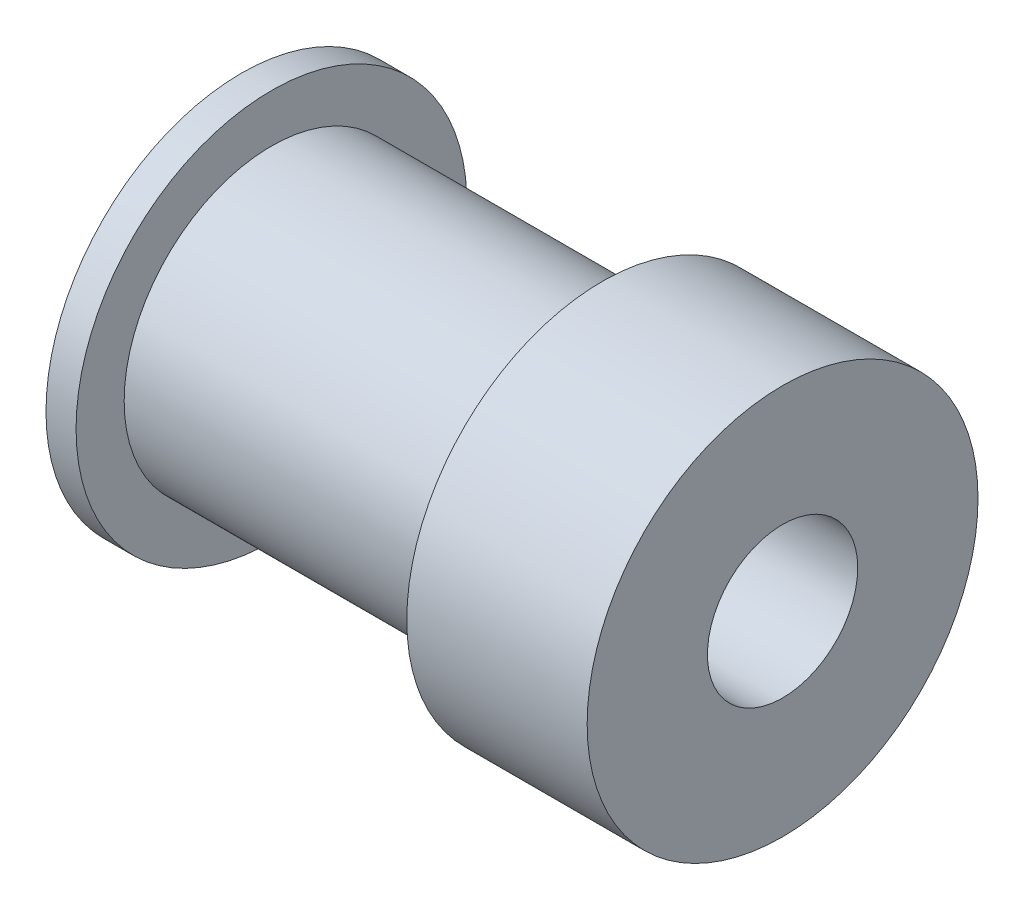
ISO-10303-21;
HEADER;
FILE_DESCRIPTION(('STEP AP214'),'2;1');
FILE_NAME('part.step','',(''),(''),'','','');
FILE_SCHEMA(('AUTOMOTIVE_DESIGN { 1 0 10303 214 1 1 1 1 }'));
ENDSEC;
DATA;
#1=APPLICATION_CONTEXT('core data for automotive mechanical design processes');
#2=APPLICATION_PROTOCOL_DEFINITION('international standard','automotive_design',2000,#1);
#3=PRODUCT_CONTEXT('',#1,'mechanical');
#4=PRODUCT('Part','Part','',(#3));
#5=PRODUCT_RELATED_PRODUCT_CATEGORY('part','',(#4));
#6=PRODUCT_DEFINITION_FORMATION('','',#4);
#7=PRODUCT_DEFINITION_CONTEXT('part definition',#1,'design');
#8=PRODUCT_DEFINITION('design','',#6,#7);
#9=PRODUCT_DEFINITION_SHAPE('','',#8);
#10=(LENGTH_UNIT() NAMED_UNIT(*) SI_UNIT(.MILLI.,.METRE.));
#11=(NAMED_UNIT(*) PLANE_ANGLE_UNIT() SI_UNIT($,.RADIAN.));
#12=(NAMED_UNIT(*) SI_UNIT($,.STERADIAN.) SOLID_ANGLE_UNIT());
#13=UNCERTAINTY_MEASURE_WITH_UNIT(LENGTH_MEASURE(1.E-05),#10,'distance_accuracy_value','');
#14=(GEOMETRIC_REPRESENTATION_CONTEXT(3) GLOBAL_UNCERTAINTY_ASSIGNED_CONTEXT((#13)) GLOBAL_UNIT_ASSIGNED_CONTEXT((#10,
#11,#12)) REPRESENTATION_CONTEXT('',''));
#15=CARTESIAN_POINT('',(0.,0.,0.));
#16=DIRECTION('',(0.,0.,1.));
#17=DIRECTION('',(1.,0.,0.));
#18=AXIS2_PLACEMENT_3D('',#15,#16,#17);
#19=CARTESIAN_POINT('',(18.,0.,0.));
#20=DIRECTION('',(-1.,0.,0.));
#21=DIRECTION('',(0.,0.,1.));
#22=AXIS2_PLACEMENT_3D('',#19,#20,#21);
#23=CYLINDRICAL_SURFACE('',#22,6.5);
#24=CARTESIAN_POINT('',(18.,0.,0.));
#25=DIRECTION('',(1.,0.,0.));
#26=DIRECTION('',(0.,0.,-1.));
#27=AXIS2_PLACEMENT_3D('',#24,#25,#26);
#28=CIRCLE('',#27,6.5);
#29=CARTESIAN_POINT('',(18.,0.,-6.5));
#30=VERTEX_POINT('',#29);
#31=EDGE_CURVE('E10',#30,#30,#28,.T.);
#32=ORIENTED_EDGE('',*,*,#31,.F.);
#33=EDGE_LOOP('',(#32));
#34=FACE_BOUND('',#33,.T.);
#35=CARTESIAN_POINT('',(12.,0.,0.));
#36=DIRECTION('',(-1.,0.,0.));
#37=DIRECTION('',(0.,0.,1.));
#38=AXIS2_PLACEMENT_3D('',#35,#36,#37);
#39=CIRCLE('',#38,6.5);
#40=CARTESIAN_POINT('',(12.,0.,6.5));
#41=VERTEX_POINT('',#40);
#42=EDGE_CURVE('E46',#41,#41,#39,.T.);
#43=ORIENTED_EDGE('',*,*,#42,.F.);
#44=EDGE_LOOP('',(#43));
#45=FACE_BOUND('',#44,.T.);
#46=ADVANCED_FACE('F30',(#34,#45),#23,.T.);
#47=CARTESIAN_POINT('',(18.,0.,0.));
#48=DIRECTION('',(1.,0.,0.));
#49=DIRECTION('',(0.,0.,-1.));
#50=AXIS2_PLACEMENT_3D('',#47,#48,#49);
#51=PLANE('',#50);
#52=ORIENTED_EDGE('',*,*,#31,.T.);
#53=EDGE_LOOP('',(#52));
#54=FACE_BOUND('',#53,.T.);
#55=CARTESIAN_POINT('',(18.,0.,0.));
#56=DIRECTION('',(1.,0.,0.));
#57=DIRECTION('',(0.,0.,-1.));
#58=AXIS2_PLACEMENT_3D('',#55,#56,#57);
#59=CIRCLE('',#58,2.5);
#60=CARTESIAN_POINT('',(18.,0.,-2.5));
#61=VERTEX_POINT('',#60);
#62=EDGE_CURVE('E41',#61,#61,#59,.T.);
#63=ORIENTED_EDGE('',*,*,#62,.F.);
#64=EDGE_LOOP('',(#63));
#65=FACE_BOUND('',#64,.T.);
#66=ADVANCED_FACE('F73',(#54,#65),#51,.T.);
#67=CARTESIAN_POINT('',(0.,0.,0.));
#68=DIRECTION('',(1.,0.,0.));
#69=DIRECTION('',(0.,0.,-1.));
#70=AXIS2_PLACEMENT_3D('',#67,#68,#69);
#71=PLANE('',#70);
#72=CARTESIAN_POINT('',(0.,0.,0.));
#73=DIRECTION('',(1.,0.,0.));
#74=DIRECTION('',(0.,0.,-1.));
#75=AXIS2_PLACEMENT_3D('',#72,#73,#74);
#76=CIRCLE('',#75,6.5);
#77=CARTESIAN_POINT('',(0.,0.,-6.5));
#78=VERTEX_POINT('',#77);
#79=EDGE_CURVE('E34',#78,#78,#76,.T.);
#80=ORIENTED_EDGE('',*,*,#79,.F.);
#81=EDGE_LOOP('',(#80));
#82=FACE_BOUND('',#81,.T.);
#83=CARTESIAN_POINT('',(0.,0.,0.));
#84=DIRECTION('',(1.,0.,0.));
#85=DIRECTION('',(0.,0.,-1.));
#86=AXIS2_PLACEMENT_3D('',#83,#84,#85);
#87=CIRCLE('',#86,2.5);
#88=CARTESIAN_POINT('',(0.,0.,-2.5));
#89=VERTEX_POINT('',#88);
#90=EDGE_CURVE('E43',#89,#89,#87,.T.);
#91=ORIENTED_EDGE('',*,*,#90,.T.);
#92=EDGE_LOOP('',(#91));
#93=FACE_BOUND('',#92,.T.);
#94=ADVANCED_FACE('F78',(#82,#93),#71,.F.);
#95=CARTESIAN_POINT('',(1.,0.,0.));
#96=DIRECTION('',(-1.,0.,0.));
#97=DIRECTION('',(0.,0.,1.));
#98=AXIS2_PLACEMENT_3D('',#95,#96,#97);
#99=CIRCLE('',#98,6.5);
#100=CARTESIAN_POINT('',(1.,0.,6.5));
#101=VERTEX_POINT('',#100);
#102=EDGE_CURVE('E49',#101,#101,#99,.T.);
#103=ORIENTED_EDGE('',*,*,#102,.T.);
#104=EDGE_LOOP('',(#103));
#105=FACE_BOUND('',#104,.T.);
#106=ORIENTED_EDGE('',*,*,#79,.T.);
#107=EDGE_LOOP('',(#106));
#108=FACE_BOUND('',#107,.T.);
#109=ADVANCED_FACE('F32',(#105,#108),#23,.T.);
#110=CARTESIAN_POINT('',(18.,0.,0.));
#111=DIRECTION('',(-1.,0.,0.));
#112=DIRECTION('',(0.,0.,1.));
#113=AXIS2_PLACEMENT_3D('',#110,#111,#112);
#114=CYLINDRICAL_SURFACE('',#113,2.5);
#115=ORIENTED_EDGE('',*,*,#62,.T.);
#116=EDGE_LOOP('',(#115));
#117=FACE_BOUND('',#116,.T.);
#118=ORIENTED_EDGE('',*,*,#90,.F.);
#119=EDGE_LOOP('',(#118));
#120=FACE_BOUND('',#119,.T.);
#121=ADVANCED_FACE('F68',(#117,#120),#114,.F.);
#122=CARTESIAN_POINT('',(12.,0.,0.));
#123=DIRECTION('',(-1.,0.,0.));
#124=DIRECTION('',(0.,0.,1.));
#125=AXIS2_PLACEMENT_3D('',#122,#123,#124);
#126=PLANE('',#125);
#127=CARTESIAN_POINT('',(12.,0.,0.));
#128=DIRECTION('',(-1.,0.,0.));
#129=DIRECTION('',(0.,0.,1.));
#130=AXIS2_PLACEMENT_3D('',#127,#128,#129);
#131=CIRCLE('',#130,4.9);
#132=CARTESIAN_POINT('',(12.,0.,4.9));
#133=VERTEX_POINT('',#132);
#134=EDGE_CURVE('E52',#133,#133,#131,.T.);
#135=ORIENTED_EDGE('',*,*,#134,.F.);
#136=EDGE_LOOP('',(#135));
#137=FACE_BOUND('',#136,.T.);
#138=ORIENTED_EDGE('',*,*,#42,.T.);
#139=EDGE_LOOP('',(#138));
#140=FACE_BOUND('',#139,.T.);
#141=ADVANCED_FACE('F64',(#137,#140),#126,.T.);
#142=CARTESIAN_POINT('',(1.,0.,0.));
#143=DIRECTION('',(-1.,0.,0.));
#144=DIRECTION('',(0.,0.,1.));
#145=AXIS2_PLACEMENT_3D('',#142,#143,#144);
#146=PLANE('',#145);
#147=CARTESIAN_POINT('',(1.,0.,0.));
#148=DIRECTION('',(-1.,0.,0.));
#149=DIRECTION('',(0.,0.,1.));
#150=AXIS2_PLACEMENT_3D('',#147,#148,#149);
#151=CIRCLE('',#150,4.9);
#152=CARTESIAN_POINT('',(1.,0.,4.9));
#153=VERTEX_POINT('',#152);
#154=EDGE_CURVE('E55',#153,#153,#151,.T.);
#155=ORIENTED_EDGE('',*,*,#154,.T.);
#156=EDGE_LOOP('',(#155));
#157=FACE_BOUND('',#156,.T.);
#158=ORIENTED_EDGE('',*,*,#102,.F.);
#159=EDGE_LOOP('',(#158));
#160=FACE_BOUND('',#159,.T.);
#161=ADVANCED_FACE('F67',(#157,#160),#146,.F.);
#162=CARTESIAN_POINT('',(12.,0.,0.));
#163=DIRECTION('',(-1.,0.,0.));
#164=DIRECTION('',(0.,0.,1.));
#165=AXIS2_PLACEMENT_3D('',#162,#163,#164);
#166=CYLINDRICAL_SURFACE('',#165,4.9);
#167=ORIENTED_EDGE('',*,*,#134,.T.);
#168=EDGE_LOOP('',(#167));
#169=FACE_BOUND('',#168,.T.);
#170=ORIENTED_EDGE('',*,*,#154,.F.);
#171=EDGE_LOOP('',(#170));
#172=FACE_BOUND('',#171,.T.);
#173=ADVANCED_FACE('F61',(#169,#172),#166,.T.);
#174=CLOSED_SHELL('',(#46,#66,#94,#109,#121,#141,#161,#173));
#175=MANIFOLD_SOLID_BREP('B2',#174);
#176=ADVANCED_BREP_SHAPE_REPRESENTATION('',(#18,#175),#14);
#177=SHAPE_DEFINITION_REPRESENTATION(#9,#176);
ENDSEC;
END-ISO-10303-21;
